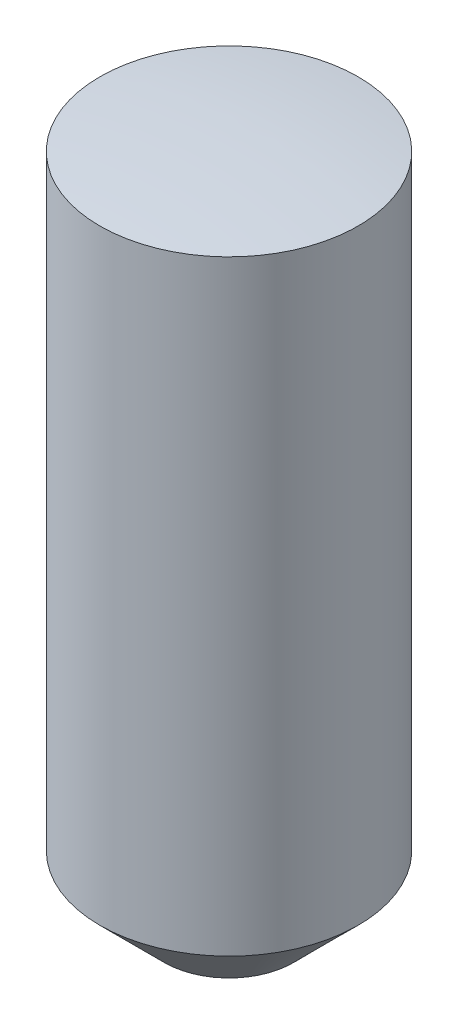
ISO-10303-21;
HEADER;
FILE_DESCRIPTION(('STEP AP214'),'2;1');
FILE_NAME('part.step','',(''),(''),'','','');
FILE_SCHEMA(('AUTOMOTIVE_DESIGN { 1 0 10303 214 1 1 1 1 }'));
ENDSEC;
DATA;
#1=APPLICATION_CONTEXT('core data for automotive mechanical design processes');
#2=APPLICATION_PROTOCOL_DEFINITION('international standard','automotive_design',2000,#1);
#3=PRODUCT_CONTEXT('',#1,'mechanical');
#4=PRODUCT('Part','Part','',(#3));
#5=PRODUCT_RELATED_PRODUCT_CATEGORY('part','',(#4));
#6=PRODUCT_DEFINITION_FORMATION('','',#4);
#7=PRODUCT_DEFINITION_CONTEXT('part definition',#1,'design');
#8=PRODUCT_DEFINITION('design','',#6,#7);
#9=PRODUCT_DEFINITION_SHAPE('','',#8);
#10=(LENGTH_UNIT() NAMED_UNIT(*) SI_UNIT(.MILLI.,.METRE.));
#11=(NAMED_UNIT(*) PLANE_ANGLE_UNIT() SI_UNIT($,.RADIAN.));
#12=(NAMED_UNIT(*) SI_UNIT($,.STERADIAN.) SOLID_ANGLE_UNIT());
#13=UNCERTAINTY_MEASURE_WITH_UNIT(LENGTH_MEASURE(1.E-05),#10,'distance_accuracy_value','');
#14=(GEOMETRIC_REPRESENTATION_CONTEXT(3) GLOBAL_UNCERTAINTY_ASSIGNED_CONTEXT((#13)) GLOBAL_UNIT_ASSIGNED_CONTEXT((#10,
#11,#12)) REPRESENTATION_CONTEXT('',''));
#15=CARTESIAN_POINT('',(0.,0.,0.));
#16=DIRECTION('',(0.,0.,1.));
#17=DIRECTION('',(1.,0.,0.));
#18=AXIS2_PLACEMENT_3D('',#15,#16,#17);
#19=CARTESIAN_POINT('',(0.,-5.25,0.));
#20=DIRECTION('',(0.,1.,0.));
#21=DIRECTION('',(0.,0.,1.));
#22=AXIS2_PLACEMENT_3D('',#19,#20,#21);
#23=CYLINDRICAL_SURFACE('',#22,1.);
#24=CARTESIAN_POINT('',(0.,-4.75,0.));
#25=DIRECTION('',(0.,1.,0.));
#26=DIRECTION('',(0.,0.,1.));
#27=AXIS2_PLACEMENT_3D('',#24,#25,#26);
#28=CIRCLE('',#27,1.);
#29=CARTESIAN_POINT('',(0.,-4.75,1.));
#30=VERTEX_POINT('',#29);
#31=EDGE_CURVE('E40',#30,#30,#28,.T.);
#32=ORIENTED_EDGE('',*,*,#31,.T.);
#33=EDGE_LOOP('',(#32));
#34=FACE_BOUND('',#33,.T.);
#35=CARTESIAN_POINT('',(0.,-0.0627460668062296,0.));
#36=DIRECTION('',(0.,-1.,0.));
#37=DIRECTION('',(0.,0.,-1.));
#38=AXIS2_PLACEMENT_3D('',#35,#36,#37);
#39=CIRCLE('',#38,1.);
#40=CARTESIAN_POINT('',(0.,-0.0627460668062296,-1.));
#41=VERTEX_POINT('',#40);
#42=EDGE_CURVE('E36',#41,#41,#39,.T.);
#43=ORIENTED_EDGE('',*,*,#42,.T.);
#44=EDGE_LOOP('',(#43));
#45=FACE_BOUND('',#44,.T.);
#46=ADVANCED_FACE('F32',(#34,#45),#23,.T.);
#47=CARTESIAN_POINT('',(0.,-5.25,0.));
#48=DIRECTION('',(0.,1.,0.));
#49=DIRECTION('',(0.,0.,1.));
#50=AXIS2_PLACEMENT_3D('',#47,#48,#49);
#51=PLANE('',#50);
#52=CARTESIAN_POINT('',(0.,-5.25,0.));
#53=DIRECTION('',(0.,1.,0.));
#54=DIRECTION('',(0.,0.,1.));
#55=AXIS2_PLACEMENT_3D('',#52,#53,#54);
#56=CIRCLE('',#55,0.499999999999996);
#57=CARTESIAN_POINT('',(0.,-5.25,0.499999999999996));
#58=VERTEX_POINT('',#57);
#59=EDGE_CURVE('E11',#58,#58,#56,.F.);
#60=ORIENTED_EDGE('',*,*,#59,.T.);
#61=EDGE_LOOP('',(#60));
#62=FACE_BOUND('',#61,.T.);
#63=ADVANCED_FACE('F56',(#62),#51,.F.);
#64=CARTESIAN_POINT('',(0.,-4.75,0.));
#65=DIRECTION('',(0.,1.,0.));
#66=DIRECTION('',(0.,0.,1.));
#67=AXIS2_PLACEMENT_3D('',#64,#65,#66);
#68=CONICAL_SURFACE('',#67,1.,0.78539816339745);
#69=ORIENTED_EDGE('',*,*,#59,.F.);
#70=EDGE_LOOP('',(#69));
#71=FACE_BOUND('',#70,.T.);
#72=ORIENTED_EDGE('',*,*,#31,.F.);
#73=EDGE_LOOP('',(#72));
#74=FACE_BOUND('',#73,.T.);
#75=ADVANCED_FACE('F34',(#71,#74),#68,.T.);
#76=CARTESIAN_POINT('',(0.,-8.,0.));
#77=DIRECTION('',(0.,-1.,0.));
#78=DIRECTION('',(-1.,0.,0.));
#79=AXIS2_PLACEMENT_3D('',#76,#77,#78);
#80=SPHERICAL_SURFACE('',#79,8.);
#81=CARTESIAN_POINT('',(0.,0.,0.));
#82=VERTEX_POINT('',#81);
#83=VERTEX_LOOP('',#82);
#84=FACE_BOUND('',#83,.T.);
#85=ORIENTED_EDGE('',*,*,#42,.F.);
#86=EDGE_LOOP('',(#85));
#87=FACE_BOUND('',#86,.T.);
#88=ADVANCED_FACE('F43',(#84,#87),#80,.T.);
#89=CLOSED_SHELL('',(#46,#63,#75,#88));
#90=MANIFOLD_SOLID_BREP('B2',#89);
#91=ADVANCED_BREP_SHAPE_REPRESENTATION('',(#18,#90),#14);
#92=SHAPE_DEFINITION_REPRESENTATION(#9,#91);
ENDSEC;
END-ISO-10303-21;
